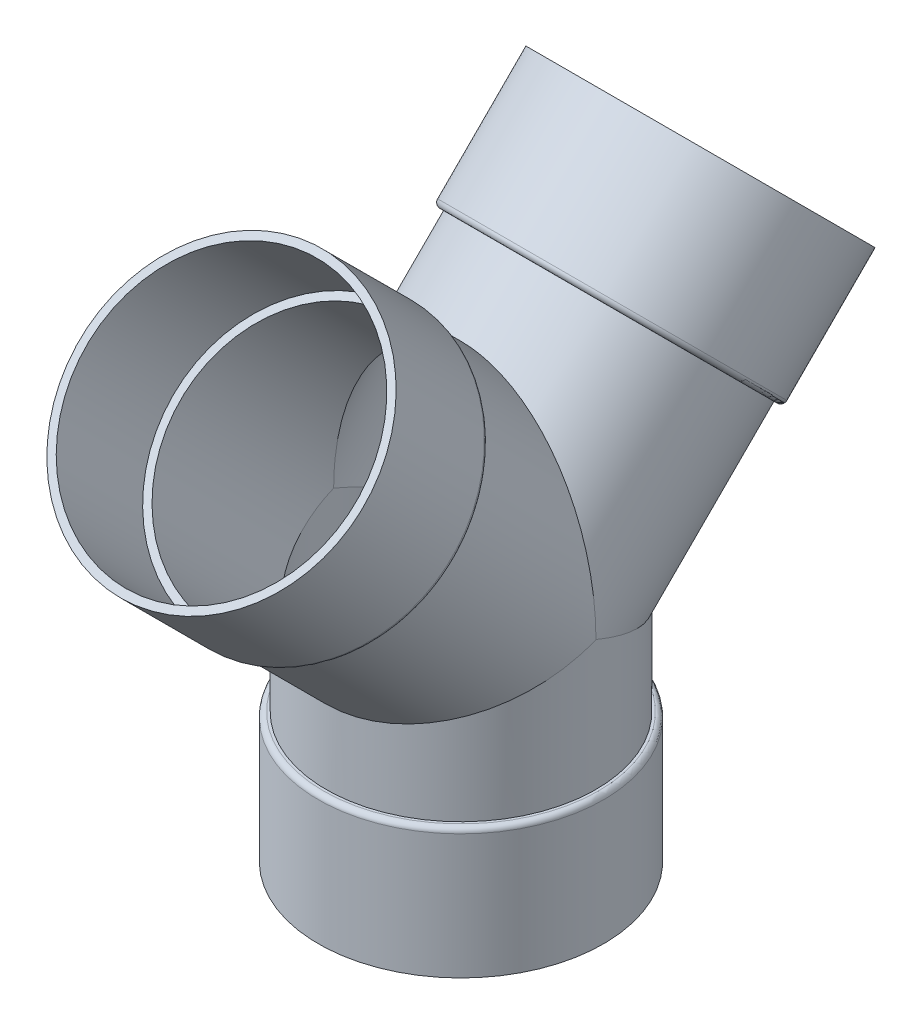
ISO-10303-21;
HEADER;
FILE_DESCRIPTION(('STEP AP214'),'2;1');
FILE_NAME('part.step','',(''),(''),'','','');
FILE_SCHEMA(('AUTOMOTIVE_DESIGN { 1 0 10303 214 1 1 1 1 }'));
ENDSEC;
DATA;
#1=APPLICATION_CONTEXT('core data for automotive mechanical design processes');
#2=APPLICATION_PROTOCOL_DEFINITION('international standard','automotive_design',2000,#1);
#3=PRODUCT_CONTEXT('',#1,'mechanical');
#4=PRODUCT('Part','Part','',(#3));
#5=PRODUCT_RELATED_PRODUCT_CATEGORY('part','',(#4));
#6=PRODUCT_DEFINITION_FORMATION('','',#4);
#7=PRODUCT_DEFINITION_CONTEXT('part definition',#1,'design');
#8=PRODUCT_DEFINITION('design','',#6,#7);
#9=PRODUCT_DEFINITION_SHAPE('','',#8);
#10=(LENGTH_UNIT() NAMED_UNIT(*) SI_UNIT(.MILLI.,.METRE.));
#11=(NAMED_UNIT(*) PLANE_ANGLE_UNIT() SI_UNIT($,.RADIAN.));
#12=(NAMED_UNIT(*) SI_UNIT($,.STERADIAN.) SOLID_ANGLE_UNIT());
#13=UNCERTAINTY_MEASURE_WITH_UNIT(LENGTH_MEASURE(1.E-05),#10,'distance_accuracy_value','');
#14=(GEOMETRIC_REPRESENTATION_CONTEXT(3) GLOBAL_UNCERTAINTY_ASSIGNED_CONTEXT((#13)) GLOBAL_UNIT_ASSIGNED_CONTEXT((#10,
#11,#12)) REPRESENTATION_CONTEXT('',''));
#15=CARTESIAN_POINT('',(0.,0.,0.));
#16=DIRECTION('',(0.,0.,1.));
#17=DIRECTION('',(1.,0.,0.));
#18=AXIS2_PLACEMENT_3D('',#15,#16,#17);
#19=CARTESIAN_POINT('',(0.,-52.1137931034483,0.));
#20=DIRECTION('',(0.,-1.,0.));
#21=DIRECTION('',(0.,0.,-1.));
#22=AXIS2_PLACEMENT_3D('',#19,#20,#21);
#23=CYLINDRICAL_SURFACE('',#22,84.1375);
#24=CARTESIAN_POINT('',(0.,80.9625,0.));
#25=DIRECTION('',(0.,-1.,0.));
#26=DIRECTION('',(0.,0.,-1.));
#27=AXIS2_PLACEMENT_3D('',#24,#25,#26);
#28=CIRCLE('',#27,84.1374999999999);
#29=CARTESIAN_POINT('',(0.,80.9625,-84.1374999999999));
#30=VERTEX_POINT('',#29);
#31=EDGE_CURVE('E142',#30,#30,#28,.T.);
#32=ORIENTED_EDGE('',*,*,#31,.F.);
#33=EDGE_LOOP('',(#32));
#34=FACE_BOUND('',#33,.T.);
#35=CARTESIAN_POINT('',(0.,161.925,0.));
#36=DIRECTION('',(0.,0.923879532511286,-0.382683432365091));
#37=DIRECTION('',(0.,-0.382683432365091,-0.923879532511286));
#38=AXIS2_PLACEMENT_3D('',#35,#36,#37);
#39=ELLIPSE('',#38,91.0697737521013,84.1375);
#40=CARTESIAN_POINT('',(84.1375,161.925,0.));
#41=VERTEX_POINT('',#40);
#42=CARTESIAN_POINT('',(-84.1374999999999,161.925,0.));
#43=VERTEX_POINT('',#42);
#44=EDGE_CURVE('E61',#41,#43,#39,.T.);
#45=ORIENTED_EDGE('',*,*,#44,.F.);
#46=CARTESIAN_POINT('',(0.,161.925,0.));
#47=DIRECTION('',(0.,0.923879532511286,0.382683432365091));
#48=DIRECTION('',(0.,-0.382683432365091,0.923879532511286));
#49=AXIS2_PLACEMENT_3D('',#46,#47,#48);
#50=ELLIPSE('',#49,91.0697737521013,84.1375);
#51=EDGE_CURVE('E148',#43,#41,#50,.T.);
#52=ORIENTED_EDGE('',*,*,#51,.F.);
#53=EDGE_LOOP('',(#45,#52));
#54=FACE_BOUND('',#53,.T.);
#55=ADVANCED_FACE('F43',(#34,#54),#23,.T.);
#56=CARTESIAN_POINT('',(0.,80.9625,88.9));
#57=DIRECTION('',(0.,-1.,0.));
#58=DIRECTION('',(0.,0.,-1.));
#59=AXIS2_PLACEMENT_3D('',#56,#57,#58);
#60=PLANE('',#59);
#61=CARTESIAN_POINT('',(0.,80.9625,0.));
#62=DIRECTION('',(0.,-1.,0.));
#63=DIRECTION('',(0.,0.,-1.));
#64=AXIS2_PLACEMENT_3D('',#61,#62,#63);
#65=CIRCLE('',#64,85.725);
#66=CARTESIAN_POINT('',(0.,80.9625,-85.725));
#67=VERTEX_POINT('',#66);
#68=EDGE_CURVE('E158',#67,#67,#65,.F.);
#69=ORIENTED_EDGE('',*,*,#68,.T.);
#70=EDGE_LOOP('',(#69));
#71=FACE_BOUND('',#70,.T.);
#72=ORIENTED_EDGE('',*,*,#31,.T.);
#73=EDGE_LOOP('',(#72));
#74=FACE_BOUND('',#73,.T.);
#75=ADVANCED_FACE('F188',(#71,#74),#60,.F.);
#76=CARTESIAN_POINT('',(0.,-52.1137931034483,0.));
#77=DIRECTION('',(0.,-1.,0.));
#78=DIRECTION('',(0.,0.,-1.));
#79=AXIS2_PLACEMENT_3D('',#76,#77,#78);
#80=CYLINDRICAL_SURFACE('',#79,88.9);
#81=CARTESIAN_POINT('',(0.,77.7875,0.));
#82=DIRECTION('',(0.,-1.,0.));
#83=DIRECTION('',(0.,0.,-1.));
#84=AXIS2_PLACEMENT_3D('',#81,#82,#83);
#85=CIRCLE('',#84,88.9);
#86=CARTESIAN_POINT('',(0.,77.7875,-88.9));
#87=VERTEX_POINT('',#86);
#88=EDGE_CURVE('E154',#87,#87,#85,.T.);
#89=ORIENTED_EDGE('',*,*,#88,.T.);
#90=EDGE_LOOP('',(#89));
#91=FACE_BOUND('',#90,.T.);
#92=CARTESIAN_POINT('',(0.,0.,0.));
#93=DIRECTION('',(0.,-1.,0.));
#94=DIRECTION('',(0.,0.,-1.));
#95=AXIS2_PLACEMENT_3D('',#92,#93,#94);
#96=CIRCLE('',#95,88.9);
#97=CARTESIAN_POINT('',(0.,0.,-88.9));
#98=VERTEX_POINT('',#97);
#99=EDGE_CURVE('E138',#98,#98,#96,.T.);
#100=ORIENTED_EDGE('',*,*,#99,.F.);
#101=EDGE_LOOP('',(#100));
#102=FACE_BOUND('',#101,.T.);
#103=ADVANCED_FACE('F194',(#91,#102),#80,.T.);
#104=CARTESIAN_POINT('',(0.,0.,88.9));
#105=DIRECTION('',(0.,1.,0.));
#106=DIRECTION('',(0.,0.,1.));
#107=AXIS2_PLACEMENT_3D('',#104,#105,#106);
#108=PLANE('',#107);
#109=CARTESIAN_POINT('',(0.,0.,0.));
#110=DIRECTION('',(0.,1.,0.));
#111=DIRECTION('',(0.,0.,1.));
#112=AXIS2_PLACEMENT_3D('',#109,#110,#111);
#113=CIRCLE('',#112,84.1375);
#114=CARTESIAN_POINT('',(0.,0.,84.1375));
#115=VERTEX_POINT('',#114);
#116=EDGE_CURVE('E117',#115,#115,#113,.F.);
#117=ORIENTED_EDGE('',*,*,#116,.F.);
#118=EDGE_LOOP('',(#117));
#119=FACE_BOUND('',#118,.T.);
#120=ORIENTED_EDGE('',*,*,#99,.T.);
#121=EDGE_LOOP('',(#120));
#122=FACE_BOUND('',#121,.T.);
#123=ADVANCED_FACE('F215',(#119,#122),#108,.F.);
#124=CARTESIAN_POINT('',(0.,248.35996516529,-212.158550860259));
#125=DIRECTION('',(0.,0.707106781186547,-0.707106781186548));
#126=DIRECTION('',(0.,0.707106781186548,0.707106781186547));
#127=AXIS2_PLACEMENT_3D('',#124,#125,#126);
#128=PLANE('',#127);
#129=CARTESIAN_POINT('',(0.,311.221758012774,-149.296758012775));
#130=DIRECTION('',(0.,0.707106781186547,-0.707106781186548));
#131=DIRECTION('',(0.,0.707106781186548,0.707106781186547));
#132=AXIS2_PLACEMENT_3D('',#129,#130,#131);
#133=CIRCLE('',#132,84.1375);
#134=CARTESIAN_POINT('',(0.,370.715954814858,-89.8025612106918));
#135=VERTEX_POINT('',#134);
#136=EDGE_CURVE('E108',#135,#135,#133,.F.);
#137=ORIENTED_EDGE('',*,*,#136,.T.);
#138=EDGE_LOOP('',(#137));
#139=FACE_BOUND('',#138,.T.);
#140=CARTESIAN_POINT('',(0.,311.221758012774,-149.296758012775));
#141=DIRECTION('',(0.,-0.707106781186547,0.707106781186548));
#142=DIRECTION('',(0.,-0.707106781186548,-0.707106781186547));
#143=AXIS2_PLACEMENT_3D('',#140,#141,#142);
#144=CIRCLE('',#143,88.9000000000001);
#145=CARTESIAN_POINT('',(0.,248.35996516529,-212.158550860259));
#146=VERTEX_POINT('',#145);
#147=EDGE_CURVE('E134',#146,#146,#144,.T.);
#148=ORIENTED_EDGE('',*,*,#147,.F.);
#149=EDGE_LOOP('',(#148));
#150=FACE_BOUND('',#149,.T.);
#151=ADVANCED_FACE('F219',(#139,#150),#128,.T.);
#152=CARTESIAN_POINT('',(0.,311.221758012774,-149.296758012775));
#153=DIRECTION('',(0.,-0.707106781186547,0.707106781186548));
#154=DIRECTION('',(0.,-0.707106781186548,-0.707106781186547));
#155=AXIS2_PLACEMENT_3D('',#152,#153,#154);
#156=CYLINDRICAL_SURFACE('',#155,88.9);
#157=CARTESIAN_POINT('',(0.,256.217689271226,-94.2926892712263));
#158=DIRECTION('',(0.,-0.707106781186547,0.707106781186548));
#159=DIRECTION('',(0.,-0.707106781186548,-0.707106781186547));
#160=AXIS2_PLACEMENT_3D('',#157,#158,#159);
#161=CIRCLE('',#160,88.9);
#162=CARTESIAN_POINT('',(0.,193.355896423742,-157.15448211871));
#163=VERTEX_POINT('',#162);
#164=EDGE_CURVE('E166',#163,#163,#161,.F.);
#165=ORIENTED_EDGE('',*,*,#164,.T.);
#166=EDGE_LOOP('',(#165));
#167=FACE_BOUND('',#166,.T.);
#168=ORIENTED_EDGE('',*,*,#147,.T.);
#169=EDGE_LOOP('',(#168));
#170=FACE_BOUND('',#169,.T.);
#171=ADVANCED_FACE('F225',(#167,#170),#156,.T.);
#172=CARTESIAN_POINT('',(0.,194.478428438875,-151.541822043042));
#173=DIRECTION('',(0.,-0.707106781186547,0.707106781186548));
#174=DIRECTION('',(0.,-0.707106781186548,-0.707106781186547));
#175=AXIS2_PLACEMENT_3D('',#172,#173,#174);
#176=PLANE('',#175);
#177=CARTESIAN_POINT('',(0.,253.972625240959,-92.047625240959));
#178=DIRECTION('',(0.,-0.707106781186547,0.707106781186548));
#179=DIRECTION('',(0.,-0.707106781186548,-0.707106781186547));
#180=AXIS2_PLACEMENT_3D('',#177,#178,#179);
#181=CIRCLE('',#180,85.725);
#182=CARTESIAN_POINT('',(0.,193.355896423742,-152.664354058176));
#183=VERTEX_POINT('',#182);
#184=EDGE_CURVE('E162',#183,#183,#181,.T.);
#185=ORIENTED_EDGE('',*,*,#184,.T.);
#186=EDGE_LOOP('',(#185));
#187=FACE_BOUND('',#186,.T.);
#188=CARTESIAN_POINT('',(0.,253.972625240959,-92.047625240959));
#189=DIRECTION('',(0.,-0.707106781186547,0.707106781186548));
#190=DIRECTION('',(0.,-0.707106781186548,-0.707106781186547));
#191=AXIS2_PLACEMENT_3D('',#188,#189,#190);
#192=CIRCLE('',#191,84.1375);
#193=CARTESIAN_POINT('',(0.,194.478428438875,-151.541822043042));
#194=VERTEX_POINT('',#193);
#195=EDGE_CURVE('E130',#194,#194,#192,.T.);
#196=ORIENTED_EDGE('',*,*,#195,.F.);
#197=EDGE_LOOP('',(#196));
#198=FACE_BOUND('',#197,.T.);
#199=ADVANCED_FACE('F232',(#187,#198),#176,.T.);
#200=CARTESIAN_POINT('',(0.,311.221758012774,-149.296758012775));
#201=DIRECTION('',(0.,-0.707106781186547,0.707106781186548));
#202=DIRECTION('',(0.,-0.707106781186548,-0.707106781186547));
#203=AXIS2_PLACEMENT_3D('',#200,#201,#202);
#204=CYLINDRICAL_SURFACE('',#203,84.1374999999999);
#205=CARTESIAN_POINT('',(0.,161.925,0.));
#206=DIRECTION('',(0.,0.,1.));
#207=DIRECTION('',(0.,-1.,0.));
#208=AXIS2_PLACEMENT_3D('',#205,#206,#207);
#209=ELLIPSE('',#208,118.988393604166,84.1374999999999);
#210=EDGE_CURVE('E58',#41,#43,#209,.T.);
#211=ORIENTED_EDGE('',*,*,#210,.F.);
#212=ORIENTED_EDGE('',*,*,#44,.T.);
#213=EDGE_LOOP('',(#211,#212));
#214=FACE_BOUND('',#213,.T.);
#215=ORIENTED_EDGE('',*,*,#195,.T.);
#216=EDGE_LOOP('',(#215));
#217=FACE_BOUND('',#216,.T.);
#218=ADVANCED_FACE('F236',(#214,#217),#204,.T.);
#219=CARTESIAN_POINT('',(0.,248.35996516529,212.158550860259));
#220=DIRECTION('',(0.,0.707106781186547,0.707106781186548));
#221=DIRECTION('',(0.,0.707106781186548,-0.707106781186547));
#222=AXIS2_PLACEMENT_3D('',#219,#220,#221);
#223=PLANE('',#222);
#224=CARTESIAN_POINT('',(0.,311.221758012774,149.296758012775));
#225=DIRECTION('',(0.,0.707106781186547,0.707106781186548));
#226=DIRECTION('',(0.,-0.707106781186548,0.707106781186547));
#227=AXIS2_PLACEMENT_3D('',#224,#225,#226);
#228=CIRCLE('',#227,84.1375);
#229=CARTESIAN_POINT('',(0.,251.727561210691,208.790954814858));
#230=VERTEX_POINT('',#229);
#231=EDGE_CURVE('E104',#230,#230,#228,.T.);
#232=ORIENTED_EDGE('',*,*,#231,.F.);
#233=EDGE_LOOP('',(#232));
#234=FACE_BOUND('',#233,.T.);
#235=CARTESIAN_POINT('',(0.,311.221758012774,149.296758012775));
#236=DIRECTION('',(0.,0.707106781186547,0.707106781186548));
#237=DIRECTION('',(0.,-0.707106781186548,0.707106781186547));
#238=AXIS2_PLACEMENT_3D('',#235,#236,#237);
#239=CIRCLE('',#238,88.9000000000001);
#240=CARTESIAN_POINT('',(0.,248.35996516529,212.158550860259));
#241=VERTEX_POINT('',#240);
#242=EDGE_CURVE('E94',#241,#241,#239,.T.);
#243=ORIENTED_EDGE('',*,*,#242,.T.);
#244=EDGE_LOOP('',(#243));
#245=FACE_BOUND('',#244,.T.);
#246=ADVANCED_FACE('F240',(#234,#245),#223,.T.);
#247=CARTESIAN_POINT('',(0.,311.221758012774,149.296758012775));
#248=DIRECTION('',(0.,-0.707106781186547,-0.707106781186548));
#249=DIRECTION('',(0.,-0.707106781186548,0.707106781186547));
#250=AXIS2_PLACEMENT_3D('',#247,#248,#249);
#251=CYLINDRICAL_SURFACE('',#250,88.9);
#252=CARTESIAN_POINT('',(0.,256.217689271226,94.2926892712263));
#253=DIRECTION('',(0.,-0.707106781186547,-0.707106781186548));
#254=DIRECTION('',(0.,0.707106781186548,-0.707106781186547));
#255=AXIS2_PLACEMENT_3D('',#252,#253,#254);
#256=CIRCLE('',#255,88.9);
#257=CARTESIAN_POINT('',(0.,319.07948211871,31.4308964237423));
#258=VERTEX_POINT('',#257);
#259=EDGE_CURVE('E52',#258,#258,#256,.F.);
#260=ORIENTED_EDGE('',*,*,#259,.T.);
#261=EDGE_LOOP('',(#260));
#262=FACE_BOUND('',#261,.T.);
#263=ORIENTED_EDGE('',*,*,#242,.F.);
#264=EDGE_LOOP('',(#263));
#265=FACE_BOUND('',#264,.T.);
#266=ADVANCED_FACE('F175',(#262,#265),#251,.T.);
#267=CARTESIAN_POINT('',(0.,194.478428438875,151.541822043042));
#268=DIRECTION('',(0.,-0.707106781186547,-0.707106781186548));
#269=DIRECTION('',(0.,-0.707106781186548,0.707106781186547));
#270=AXIS2_PLACEMENT_3D('',#267,#268,#269);
#271=PLANE('',#270);
#272=CARTESIAN_POINT('',(0.,253.972625240959,92.047625240959));
#273=DIRECTION('',(0.,-0.707106781186547,-0.707106781186548));
#274=DIRECTION('',(0.,0.707106781186548,-0.707106781186547));
#275=AXIS2_PLACEMENT_3D('',#272,#273,#274);
#276=CIRCLE('',#275,85.725);
#277=CARTESIAN_POINT('',(0.,314.589354058175,31.4308964237422));
#278=VERTEX_POINT('',#277);
#279=EDGE_CURVE('E11',#278,#278,#276,.T.);
#280=ORIENTED_EDGE('',*,*,#279,.T.);
#281=EDGE_LOOP('',(#280));
#282=FACE_BOUND('',#281,.T.);
#283=CARTESIAN_POINT('',(0.,253.972625240959,92.047625240959));
#284=DIRECTION('',(0.,0.707106781186547,0.707106781186548));
#285=DIRECTION('',(0.,-0.707106781186548,0.707106781186547));
#286=AXIS2_PLACEMENT_3D('',#283,#284,#285);
#287=CIRCLE('',#286,84.1375);
#288=CARTESIAN_POINT('',(0.,194.478428438875,151.541822043042));
#289=VERTEX_POINT('',#288);
#290=EDGE_CURVE('E88',#289,#289,#287,.T.);
#291=ORIENTED_EDGE('',*,*,#290,.T.);
#292=EDGE_LOOP('',(#291));
#293=FACE_BOUND('',#292,.T.);
#294=ADVANCED_FACE('F246',(#282,#293),#271,.T.);
#295=CARTESIAN_POINT('',(0.,311.221758012774,149.296758012775));
#296=DIRECTION('',(0.,-0.707106781186547,-0.707106781186548));
#297=DIRECTION('',(0.,-0.707106781186548,0.707106781186547));
#298=AXIS2_PLACEMENT_3D('',#295,#296,#297);
#299=CYLINDRICAL_SURFACE('',#298,84.1374999999999);
#300=ORIENTED_EDGE('',*,*,#290,.F.);
#301=EDGE_LOOP('',(#300));
#302=FACE_BOUND('',#301,.T.);
#303=ORIENTED_EDGE('',*,*,#210,.T.);
#304=ORIENTED_EDGE('',*,*,#51,.T.);
#305=EDGE_LOOP('',(#303,#304));
#306=FACE_BOUND('',#305,.T.);
#307=ADVANCED_FACE('F249',(#302,#306),#299,.T.);
#308=CARTESIAN_POINT('',(0.,-52.1137931034483,0.));
#309=DIRECTION('',(0.,-1.,0.));
#310=DIRECTION('',(0.,0.,-1.));
#311=AXIS2_PLACEMENT_3D('',#308,#309,#310);
#312=CYLINDRICAL_SURFACE('',#311,79.375);
#313=CARTESIAN_POINT('',(0.,76.2,0.));
#314=DIRECTION('',(0.,-1.,0.));
#315=DIRECTION('',(0.,0.,-1.));
#316=AXIS2_PLACEMENT_3D('',#313,#314,#315);
#317=CIRCLE('',#316,79.375);
#318=CARTESIAN_POINT('',(0.,76.2,-79.375));
#319=VERTEX_POINT('',#318);
#320=EDGE_CURVE('E78',#319,#319,#317,.T.);
#321=ORIENTED_EDGE('',*,*,#320,.T.);
#322=EDGE_LOOP('',(#321));
#323=FACE_BOUND('',#322,.T.);
#324=CARTESIAN_POINT('',(0.,161.925,0.));
#325=DIRECTION('',(0.,-0.923879532511287,0.38268343236509));
#326=DIRECTION('',(0.,0.38268343236509,0.923879532511286));
#327=AXIS2_PLACEMENT_3D('',#324,#325,#326);
#328=ELLIPSE('',#327,85.9148808982088,79.375);
#329=CARTESIAN_POINT('',(79.3749999999999,161.925,0.));
#330=VERTEX_POINT('',#329);
#331=CARTESIAN_POINT('',(-79.3749999999999,161.925,0.));
#332=VERTEX_POINT('',#331);
#333=EDGE_CURVE('E71',#330,#332,#328,.F.);
#334=ORIENTED_EDGE('',*,*,#333,.T.);
#335=CARTESIAN_POINT('',(0.,161.925,0.));
#336=DIRECTION('',(0.,-0.923879532511287,-0.38268343236509));
#337=DIRECTION('',(0.,0.38268343236509,-0.923879532511286));
#338=AXIS2_PLACEMENT_3D('',#335,#336,#337);
#339=ELLIPSE('',#338,85.9148808982088,79.375);
#340=EDGE_CURVE('E74',#332,#330,#339,.F.);
#341=ORIENTED_EDGE('',*,*,#340,.T.);
#342=EDGE_LOOP('',(#334,#341));
#343=FACE_BOUND('',#342,.T.);
#344=ADVANCED_FACE('F73',(#323,#343),#312,.F.);
#345=CARTESIAN_POINT('',(0.,76.2,88.9));
#346=DIRECTION('',(0.,-1.,0.));
#347=DIRECTION('',(0.,0.,-1.));
#348=AXIS2_PLACEMENT_3D('',#345,#346,#347);
#349=PLANE('',#348);
#350=CARTESIAN_POINT('',(0.,76.2,0.));
#351=DIRECTION('',(0.,-1.,0.));
#352=DIRECTION('',(0.,0.,-1.));
#353=AXIS2_PLACEMENT_3D('',#350,#351,#352);
#354=CIRCLE('',#353,84.1375);
#355=CARTESIAN_POINT('',(0.,76.2,-84.1375));
#356=VERTEX_POINT('',#355);
#357=EDGE_CURVE('E98',#356,#356,#354,.T.);
#358=ORIENTED_EDGE('',*,*,#357,.T.);
#359=EDGE_LOOP('',(#358));
#360=FACE_BOUND('',#359,.T.);
#361=ORIENTED_EDGE('',*,*,#320,.F.);
#362=EDGE_LOOP('',(#361));
#363=FACE_BOUND('',#362,.T.);
#364=ADVANCED_FACE('F274',(#360,#363),#349,.T.);
#365=CARTESIAN_POINT('',(0.,-52.1137931034483,0.));
#366=DIRECTION('',(0.,-1.,0.));
#367=DIRECTION('',(0.,0.,-1.));
#368=AXIS2_PLACEMENT_3D('',#365,#366,#367);
#369=CYLINDRICAL_SURFACE('',#368,84.1375);
#370=ORIENTED_EDGE('',*,*,#116,.T.);
#371=EDGE_LOOP('',(#370));
#372=FACE_BOUND('',#371,.T.);
#373=ORIENTED_EDGE('',*,*,#357,.F.);
#374=EDGE_LOOP('',(#373));
#375=FACE_BOUND('',#374,.T.);
#376=ADVANCED_FACE('F270',(#372,#375),#369,.F.);
#377=CARTESIAN_POINT('',(0.,311.221758012774,-149.296758012775));
#378=DIRECTION('',(0.,-0.707106781186547,0.707106781186548));
#379=DIRECTION('',(0.,-0.707106781186548,-0.707106781186547));
#380=AXIS2_PLACEMENT_3D('',#377,#378,#379);
#381=CYLINDRICAL_SURFACE('',#380,84.1375);
#382=ORIENTED_EDGE('',*,*,#136,.F.);
#383=EDGE_LOOP('',(#382));
#384=FACE_BOUND('',#383,.T.);
#385=CARTESIAN_POINT('',(0.,257.34022128636,-95.4152212863599));
#386=DIRECTION('',(0.,-0.707106781186547,0.707106781186548));
#387=DIRECTION('',(0.,-0.707106781186548,-0.707106781186547));
#388=AXIS2_PLACEMENT_3D('',#385,#386,#387);
#389=CIRCLE('',#388,84.1375);
#390=CARTESIAN_POINT('',(0.,197.846024484276,-154.909418088443));
#391=VERTEX_POINT('',#390);
#392=EDGE_CURVE('E103',#391,#391,#389,.T.);
#393=ORIENTED_EDGE('',*,*,#392,.T.);
#394=EDGE_LOOP('',(#393));
#395=FACE_BOUND('',#394,.T.);
#396=ADVANCED_FACE('F266',(#384,#395),#381,.F.);
#397=CARTESIAN_POINT('',(0.,197.846024484276,-154.909418088443));
#398=DIRECTION('',(0.,-0.707106781186547,0.707106781186548));
#399=DIRECTION('',(0.,-0.707106781186548,-0.707106781186547));
#400=AXIS2_PLACEMENT_3D('',#397,#398,#399);
#401=PLANE('',#400);
#402=ORIENTED_EDGE('',*,*,#392,.F.);
#403=EDGE_LOOP('',(#402));
#404=FACE_BOUND('',#403,.T.);
#405=CARTESIAN_POINT('',(0.,257.34022128636,-95.4152212863599));
#406=DIRECTION('',(0.,-0.707106781186547,0.707106781186548));
#407=DIRECTION('',(0.,-0.707106781186548,-0.707106781186547));
#408=AXIS2_PLACEMENT_3D('',#405,#406,#407);
#409=CIRCLE('',#408,79.3749999999999);
#410=CARTESIAN_POINT('',(0.,201.213620529677,-151.541822043042));
#411=VERTEX_POINT('',#410);
#412=EDGE_CURVE('E99',#411,#411,#409,.T.);
#413=ORIENTED_EDGE('',*,*,#412,.T.);
#414=EDGE_LOOP('',(#413));
#415=FACE_BOUND('',#414,.T.);
#416=ADVANCED_FACE('F263',(#404,#415),#401,.F.);
#417=CARTESIAN_POINT('',(0.,311.221758012774,-149.296758012775));
#418=DIRECTION('',(0.,-0.707106781186547,0.707106781186548));
#419=DIRECTION('',(0.,-0.707106781186548,-0.707106781186547));
#420=AXIS2_PLACEMENT_3D('',#417,#418,#419);
#421=CYLINDRICAL_SURFACE('',#420,79.3749999999999);
#422=CARTESIAN_POINT('',(0.,161.925,0.));
#423=DIRECTION('',(0.,0.,1.));
#424=DIRECTION('',(0.,-1.,0.));
#425=AXIS2_PLACEMENT_3D('',#422,#423,#424);
#426=ELLIPSE('',#425,112.253201513364,79.3749999999999);
#427=EDGE_CURVE('E82',#330,#332,#426,.T.);
#428=ORIENTED_EDGE('',*,*,#427,.T.);
#429=ORIENTED_EDGE('',*,*,#333,.F.);
#430=EDGE_LOOP('',(#428,#429));
#431=FACE_BOUND('',#430,.T.);
#432=ORIENTED_EDGE('',*,*,#412,.F.);
#433=EDGE_LOOP('',(#432));
#434=FACE_BOUND('',#433,.T.);
#435=ADVANCED_FACE('F85',(#431,#434),#421,.F.);
#436=CARTESIAN_POINT('',(0.,311.221758012774,149.296758012775));
#437=DIRECTION('',(0.,-0.707106781186547,-0.707106781186548));
#438=DIRECTION('',(0.,-0.707106781186548,0.707106781186547));
#439=AXIS2_PLACEMENT_3D('',#436,#437,#438);
#440=CYLINDRICAL_SURFACE('',#439,84.1375);
#441=ORIENTED_EDGE('',*,*,#231,.T.);
#442=EDGE_LOOP('',(#441));
#443=FACE_BOUND('',#442,.T.);
#444=CARTESIAN_POINT('',(0.,257.34022128636,95.4152212863599));
#445=DIRECTION('',(0.,-0.707106781186547,-0.707106781186548));
#446=DIRECTION('',(0.,0.707106781186548,-0.707106781186547));
#447=AXIS2_PLACEMENT_3D('',#444,#445,#446);
#448=CIRCLE('',#447,84.1375);
#449=CARTESIAN_POINT('',(0.,316.834418088443,35.9210244842768));
#450=VERTEX_POINT('',#449);
#451=EDGE_CURVE('E113',#450,#450,#448,.F.);
#452=ORIENTED_EDGE('',*,*,#451,.F.);
#453=EDGE_LOOP('',(#452));
#454=FACE_BOUND('',#453,.T.);
#455=ADVANCED_FACE('F256',(#443,#454),#440,.F.);
#456=CARTESIAN_POINT('',(0.,197.846024484276,154.909418088443));
#457=DIRECTION('',(0.,-0.707106781186547,-0.707106781186548));
#458=DIRECTION('',(0.,-0.707106781186548,0.707106781186547));
#459=AXIS2_PLACEMENT_3D('',#456,#457,#458);
#460=PLANE('',#459);
#461=ORIENTED_EDGE('',*,*,#451,.T.);
#462=EDGE_LOOP('',(#461));
#463=FACE_BOUND('',#462,.T.);
#464=CARTESIAN_POINT('',(0.,257.34022128636,95.4152212863599));
#465=DIRECTION('',(0.,-0.707106781186547,-0.707106781186548));
#466=DIRECTION('',(0.,0.707106781186548,-0.707106781186547));
#467=AXIS2_PLACEMENT_3D('',#464,#465,#466);
#468=CIRCLE('',#467,79.3749999999999);
#469=CARTESIAN_POINT('',(0.,313.466822043042,39.2886205296778));
#470=VERTEX_POINT('',#469);
#471=EDGE_CURVE('E109',#470,#470,#468,.F.);
#472=ORIENTED_EDGE('',*,*,#471,.F.);
#473=EDGE_LOOP('',(#472));
#474=FACE_BOUND('',#473,.T.);
#475=ADVANCED_FACE('F206',(#463,#474),#460,.F.);
#476=CARTESIAN_POINT('',(0.,311.221758012774,149.296758012775));
#477=DIRECTION('',(0.,-0.707106781186547,-0.707106781186548));
#478=DIRECTION('',(0.,-0.707106781186548,0.707106781186547));
#479=AXIS2_PLACEMENT_3D('',#476,#477,#478);
#480=CYLINDRICAL_SURFACE('',#479,79.3749999999999);
#481=ORIENTED_EDGE('',*,*,#471,.T.);
#482=EDGE_LOOP('',(#481));
#483=FACE_BOUND('',#482,.T.);
#484=ORIENTED_EDGE('',*,*,#427,.F.);
#485=ORIENTED_EDGE('',*,*,#340,.F.);
#486=EDGE_LOOP('',(#484,#485));
#487=FACE_BOUND('',#486,.T.);
#488=ADVANCED_FACE('F81',(#483,#487),#480,.F.);
#489=CARTESIAN_POINT('',(0.,77.7875,0.));
#490=DIRECTION('',(0.,-1.,0.));
#491=DIRECTION('',(0.,0.,-1.));
#492=AXIS2_PLACEMENT_3D('',#489,#490,#491);
#493=TOROIDAL_SURFACE('',#492,85.725,3.175);
#494=ORIENTED_EDGE('',*,*,#68,.F.);
#495=EDGE_LOOP('',(#494));
#496=FACE_BOUND('',#495,.T.);
#497=ORIENTED_EDGE('',*,*,#88,.F.);
#498=EDGE_LOOP('',(#497));
#499=FACE_BOUND('',#498,.T.);
#500=ADVANCED_FACE('F184',(#496,#499),#493,.T.);
#501=CARTESIAN_POINT('',(0.,256.217689271226,-94.2926892712263));
#502=DIRECTION('',(0.,-0.707106781186547,0.707106781186548));
#503=DIRECTION('',(0.,-0.707106781186548,-0.707106781186547));
#504=AXIS2_PLACEMENT_3D('',#501,#502,#503);
#505=TOROIDAL_SURFACE('',#504,85.725,3.175);
#506=ORIENTED_EDGE('',*,*,#164,.F.);
#507=EDGE_LOOP('',(#506));
#508=FACE_BOUND('',#507,.T.);
#509=ORIENTED_EDGE('',*,*,#184,.F.);
#510=EDGE_LOOP('',(#509));
#511=FACE_BOUND('',#510,.T.);
#512=ADVANCED_FACE('F179',(#508,#511),#505,.T.);
#513=CARTESIAN_POINT('',(0.,256.217689271226,94.2926892712263));
#514=DIRECTION('',(0.,-0.707106781186547,-0.707106781186548));
#515=DIRECTION('',(0.,0.707106781186548,-0.707106781186547));
#516=AXIS2_PLACEMENT_3D('',#513,#514,#515);
#517=TOROIDAL_SURFACE('',#516,85.725,3.175);
#518=ORIENTED_EDGE('',*,*,#279,.F.);
#519=EDGE_LOOP('',(#518));
#520=FACE_BOUND('',#519,.T.);
#521=ORIENTED_EDGE('',*,*,#259,.F.);
#522=EDGE_LOOP('',(#521));
#523=FACE_BOUND('',#522,.T.);
#524=ADVANCED_FACE('F45',(#520,#523),#517,.T.);
#525=CLOSED_SHELL('',(#55,#75,#103,#123,#151,#171,#199,#218,#246,#266,#294,#307,#344,#364,#376,
#396,#416,#435,#455,#475,#488,#500,#512,#524));
#526=MANIFOLD_SOLID_BREP('B2',#525);
#527=ADVANCED_BREP_SHAPE_REPRESENTATION('',(#18,#526),#14);
#528=SHAPE_DEFINITION_REPRESENTATION(#9,#527);
ENDSEC;
END-ISO-10303-21;
